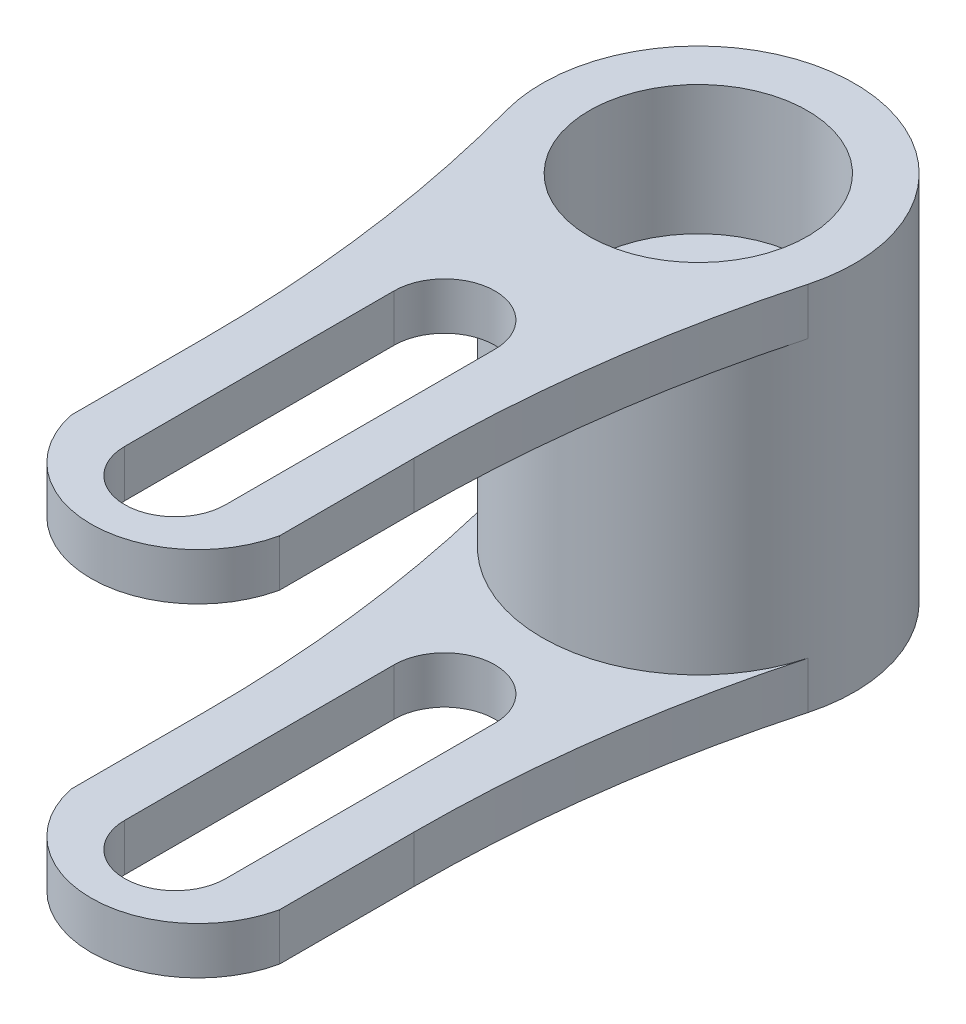
ISO-10303-21;
HEADER;
FILE_DESCRIPTION(('STEP AP214'),'2;1');
FILE_NAME('part.step','',(''),(''),'','','');
FILE_SCHEMA(('AUTOMOTIVE_DESIGN { 1 0 10303 214 1 1 1 1 }'));
ENDSEC;
DATA;
#1=APPLICATION_CONTEXT('core data for automotive mechanical design processes');
#2=APPLICATION_PROTOCOL_DEFINITION('international standard','automotive_design',2000,#1);
#3=PRODUCT_CONTEXT('',#1,'mechanical');
#4=PRODUCT('Part','Part','',(#3));
#5=PRODUCT_RELATED_PRODUCT_CATEGORY('part','',(#4));
#6=PRODUCT_DEFINITION_FORMATION('','',#4);
#7=PRODUCT_DEFINITION_CONTEXT('part definition',#1,'design');
#8=PRODUCT_DEFINITION('design','',#6,#7);
#9=PRODUCT_DEFINITION_SHAPE('','',#8);
#10=(LENGTH_UNIT() NAMED_UNIT(*) SI_UNIT(.MILLI.,.METRE.));
#11=(NAMED_UNIT(*) PLANE_ANGLE_UNIT() SI_UNIT($,.RADIAN.));
#12=(NAMED_UNIT(*) SI_UNIT($,.STERADIAN.) SOLID_ANGLE_UNIT());
#13=UNCERTAINTY_MEASURE_WITH_UNIT(LENGTH_MEASURE(1.E-05),#10,'distance_accuracy_value','');
#14=(GEOMETRIC_REPRESENTATION_CONTEXT(3) GLOBAL_UNCERTAINTY_ASSIGNED_CONTEXT((#13)) GLOBAL_UNIT_ASSIGNED_CONTEXT((#10,
#11,#12)) REPRESENTATION_CONTEXT('',''));
#15=CARTESIAN_POINT('',(0.,0.,0.));
#16=DIRECTION('',(0.,0.,1.));
#17=DIRECTION('',(1.,0.,0.));
#18=AXIS2_PLACEMENT_3D('',#15,#16,#17);
#19=CARTESIAN_POINT('',(0.,6.8875,0.));
#20=DIRECTION('',(0.,1.,0.));
#21=DIRECTION('',(0.,0.,1.));
#22=AXIS2_PLACEMENT_3D('',#19,#20,#21);
#23=PLANE('',#22);
#24=CARTESIAN_POINT('',(0.,6.8875,19.425));
#25=DIRECTION('',(0.,1.,0.));
#26=DIRECTION('',(0.,0.,1.));
#27=AXIS2_PLACEMENT_3D('',#24,#25,#26);
#28=CIRCLE('',#27,1.875);
#29=CARTESIAN_POINT('',(-1.875,6.8875,19.425));
#30=VERTEX_POINT('',#29);
#31=CARTESIAN_POINT('',(1.875,6.8875,19.425));
#32=VERTEX_POINT('',#31);
#33=EDGE_CURVE('E308',#30,#32,#28,.T.);
#34=ORIENTED_EDGE('',*,*,#33,.F.);
#35=DIRECTION('',(0.,0.,1.));
#36=VECTOR('',#35,1.);
#37=CARTESIAN_POINT('',(-1.875,6.8875,0.));
#38=LINE('',#37,#36);
#39=CARTESIAN_POINT('',(-1.875,6.8875,9.425));
#40=VERTEX_POINT('',#39);
#41=EDGE_CURVE('E313',#40,#30,#38,.T.);
#42=ORIENTED_EDGE('',*,*,#41,.F.);
#43=CARTESIAN_POINT('',(0.,6.8875,9.425));
#44=DIRECTION('',(0.,1.,0.));
#45=DIRECTION('',(0.,0.,1.));
#46=AXIS2_PLACEMENT_3D('',#43,#44,#45);
#47=CIRCLE('',#46,1.875);
#48=CARTESIAN_POINT('',(1.875,6.8875,9.425));
#49=VERTEX_POINT('',#48);
#50=EDGE_CURVE('E317',#49,#40,#47,.T.);
#51=ORIENTED_EDGE('',*,*,#50,.F.);
#52=DIRECTION('',(0.,0.,1.));
#53=VECTOR('',#52,1.);
#54=CARTESIAN_POINT('',(1.875,6.8875,0.));
#55=LINE('',#54,#53);
#56=EDGE_CURVE('E324',#49,#32,#55,.T.);
#57=ORIENTED_EDGE('',*,*,#56,.T.);
#58=EDGE_LOOP('',(#34,#42,#51,#57));
#59=FACE_BOUND('',#58,.T.);
#60=CARTESIAN_POINT('',(0.,6.8875,0.));
#61=DIRECTION('',(0.,1.,0.));
#62=DIRECTION('',(0.,0.,1.));
#63=AXIS2_PLACEMENT_3D('',#60,#61,#62);
#64=CIRCLE('',#63,4.05);
#65=CARTESIAN_POINT('',(0.,6.8875,4.05));
#66=VERTEX_POINT('',#65);
#67=EDGE_CURVE('E378',#66,#66,#64,.T.);
#68=ORIENTED_EDGE('',*,*,#67,.F.);
#69=EDGE_LOOP('',(#68));
#70=FACE_BOUND('',#69,.T.);
#71=CARTESIAN_POINT('',(0.,6.8875,18.585));
#72=DIRECTION('',(0.,1.,0.));
#73=DIRECTION('',(0.,0.,1.));
#74=AXIS2_PLACEMENT_3D('',#71,#72,#73);
#75=CIRCLE('',#74,3.965);
#76=CARTESIAN_POINT('',(-3.875,6.8875,19.425));
#77=VERTEX_POINT('',#76);
#78=CARTESIAN_POINT('',(3.875,6.8875,19.425));
#79=VERTEX_POINT('',#78);
#80=EDGE_CURVE('E202',#77,#79,#75,.T.);
#81=ORIENTED_EDGE('',*,*,#80,.T.);
#82=DIRECTION('',(0.,0.,-1.));
#83=VECTOR('',#82,1.);
#84=CARTESIAN_POINT('',(3.87499999999999,6.8875,0.));
#85=LINE('',#84,#83);
#86=CARTESIAN_POINT('',(3.875,6.8875,14.425));
#87=VERTEX_POINT('',#86);
#88=EDGE_CURVE('E326',#79,#87,#85,.T.);
#89=ORIENTED_EDGE('',*,*,#88,.T.);
#90=CARTESIAN_POINT('',(53.0844155844154,6.8875,14.425));
#91=DIRECTION('',(0.,1.,0.));
#92=DIRECTION('',(0.,0.,1.));
#93=AXIS2_PLACEMENT_3D('',#90,#91,#92);
#94=CIRCLE('',#93,49.2094155844154);
#95=CARTESIAN_POINT('',(5.59703474611784,6.8875,1.52092144792214));
#96=VERTEX_POINT('',#95);
#97=EDGE_CURVE('E328',#87,#96,#94,.F.);
#98=ORIENTED_EDGE('',*,*,#97,.T.);
#99=CARTESIAN_POINT('',(0.,6.8875,0.));
#100=DIRECTION('',(0.,1.,0.));
#101=DIRECTION('',(0.,0.,1.));
#102=AXIS2_PLACEMENT_3D('',#99,#100,#101);
#103=CIRCLE('',#102,5.8);
#104=CARTESIAN_POINT('',(-5.59703474611784,6.8875,1.52092144792214));
#105=VERTEX_POINT('',#104);
#106=EDGE_CURVE('E330',#96,#105,#103,.T.);
#107=ORIENTED_EDGE('',*,*,#106,.T.);
#108=CARTESIAN_POINT('',(-53.0844155844154,6.8875,14.425));
#109=DIRECTION('',(0.,1.,0.));
#110=DIRECTION('',(0.,0.,1.));
#111=AXIS2_PLACEMENT_3D('',#108,#109,#110);
#112=CIRCLE('',#111,49.2094155844154);
#113=CARTESIAN_POINT('',(-3.875,6.8875,14.425));
#114=VERTEX_POINT('',#113);
#115=EDGE_CURVE('E218',#105,#114,#112,.F.);
#116=ORIENTED_EDGE('',*,*,#115,.T.);
#117=DIRECTION('',(0.,0.,1.));
#118=VECTOR('',#117,1.);
#119=CARTESIAN_POINT('',(-3.87499999999999,6.8875,0.));
#120=LINE('',#119,#118);
#121=EDGE_CURVE('E216',#114,#77,#120,.T.);
#122=ORIENTED_EDGE('',*,*,#121,.T.);
#123=EDGE_LOOP('',(#81,#89,#98,#107,#116,#122));
#124=FACE_BOUND('',#123,.T.);
#125=ADVANCED_FACE('F66',(#59,#70,#124),#23,.T.);
#126=CARTESIAN_POINT('',(0.,-6.8875,0.));
#127=DIRECTION('',(0.,1.,0.));
#128=DIRECTION('',(0.,0.,1.));
#129=AXIS2_PLACEMENT_3D('',#126,#127,#128);
#130=PLANE('',#129);
#131=CARTESIAN_POINT('',(0.,-6.8875,19.425));
#132=DIRECTION('',(0.,1.,0.));
#133=DIRECTION('',(0.,0.,1.));
#134=AXIS2_PLACEMENT_3D('',#131,#132,#133);
#135=CIRCLE('',#134,1.875);
#136=CARTESIAN_POINT('',(-1.875,-6.8875,19.425));
#137=VERTEX_POINT('',#136);
#138=CARTESIAN_POINT('',(1.875,-6.8875,19.425));
#139=VERTEX_POINT('',#138);
#140=EDGE_CURVE('E278',#137,#139,#135,.T.);
#141=ORIENTED_EDGE('',*,*,#140,.T.);
#142=DIRECTION('',(0.,0.,1.));
#143=VECTOR('',#142,1.);
#144=CARTESIAN_POINT('',(1.875,-6.8875,0.));
#145=LINE('',#144,#143);
#146=CARTESIAN_POINT('',(1.875,-6.8875,9.425));
#147=VERTEX_POINT('',#146);
#148=EDGE_CURVE('E291',#147,#139,#145,.T.);
#149=ORIENTED_EDGE('',*,*,#148,.F.);
#150=CARTESIAN_POINT('',(0.,-6.8875,9.425));
#151=DIRECTION('',(0.,1.,0.));
#152=DIRECTION('',(0.,0.,1.));
#153=AXIS2_PLACEMENT_3D('',#150,#151,#152);
#154=CIRCLE('',#153,1.875);
#155=CARTESIAN_POINT('',(-1.875,-6.8875,9.425));
#156=VERTEX_POINT('',#155);
#157=EDGE_CURVE('E289',#147,#156,#154,.T.);
#158=ORIENTED_EDGE('',*,*,#157,.T.);
#159=DIRECTION('',(0.,0.,1.));
#160=VECTOR('',#159,1.);
#161=CARTESIAN_POINT('',(-1.875,-6.8875,0.));
#162=LINE('',#161,#160);
#163=EDGE_CURVE('E272',#156,#137,#162,.T.);
#164=ORIENTED_EDGE('',*,*,#163,.T.);
#165=EDGE_LOOP('',(#141,#149,#158,#164));
#166=FACE_BOUND('',#165,.T.);
#167=DIRECTION('',(0.,0.,-1.));
#168=VECTOR('',#167,1.);
#169=CARTESIAN_POINT('',(3.87499999999999,-6.8875,0.));
#170=LINE('',#169,#168);
#171=CARTESIAN_POINT('',(3.875,-6.8875,19.425));
#172=VERTEX_POINT('',#171);
#173=CARTESIAN_POINT('',(3.875,-6.8875,14.425));
#174=VERTEX_POINT('',#173);
#175=EDGE_CURVE('E295',#172,#174,#170,.T.);
#176=ORIENTED_EDGE('',*,*,#175,.F.);
#177=CARTESIAN_POINT('',(0.,-6.8875,18.585));
#178=DIRECTION('',(0.,1.,0.));
#179=DIRECTION('',(0.,0.,1.));
#180=AXIS2_PLACEMENT_3D('',#177,#178,#179);
#181=CIRCLE('',#180,3.965);
#182=CARTESIAN_POINT('',(-3.875,-6.8875,19.425));
#183=VERTEX_POINT('',#182);
#184=EDGE_CURVE('E213',#183,#172,#181,.T.);
#185=ORIENTED_EDGE('',*,*,#184,.F.);
#186=DIRECTION('',(0.,0.,1.));
#187=VECTOR('',#186,1.);
#188=CARTESIAN_POINT('',(-3.87499999999999,-6.8875,0.));
#189=LINE('',#188,#187);
#190=CARTESIAN_POINT('',(-3.875,-6.8875,14.425));
#191=VERTEX_POINT('',#190);
#192=EDGE_CURVE('E306',#191,#183,#189,.T.);
#193=ORIENTED_EDGE('',*,*,#192,.F.);
#194=CARTESIAN_POINT('',(-53.0844155844154,-6.8875,14.425));
#195=DIRECTION('',(0.,1.,0.));
#196=DIRECTION('',(0.,0.,1.));
#197=AXIS2_PLACEMENT_3D('',#194,#195,#196);
#198=CIRCLE('',#197,49.2094155844154);
#199=CARTESIAN_POINT('',(-5.59703474611784,-6.8875,1.52092144792214));
#200=VERTEX_POINT('',#199);
#201=EDGE_CURVE('E304',#200,#191,#198,.F.);
#202=ORIENTED_EDGE('',*,*,#201,.F.);
#203=CARTESIAN_POINT('',(0.,-6.8875,0.));
#204=DIRECTION('',(0.,1.,0.));
#205=DIRECTION('',(0.,0.,1.));
#206=AXIS2_PLACEMENT_3D('',#203,#204,#205);
#207=CIRCLE('',#206,5.8);
#208=CARTESIAN_POINT('',(5.59703474611784,-6.8875,1.52092144792214));
#209=VERTEX_POINT('',#208);
#210=EDGE_CURVE('E301',#209,#200,#207,.T.);
#211=ORIENTED_EDGE('',*,*,#210,.F.);
#212=CARTESIAN_POINT('',(53.0844155844154,-6.8875,14.425));
#213=DIRECTION('',(0.,1.,0.));
#214=DIRECTION('',(0.,0.,1.));
#215=AXIS2_PLACEMENT_3D('',#212,#213,#214);
#216=CIRCLE('',#215,49.2094155844154);
#217=EDGE_CURVE('E298',#174,#209,#216,.F.);
#218=ORIENTED_EDGE('',*,*,#217,.F.);
#219=EDGE_LOOP('',(#176,#185,#193,#202,#211,#218));
#220=FACE_BOUND('',#219,.T.);
#221=ADVANCED_FACE('F286',(#166,#220),#130,.F.);
#222=CARTESIAN_POINT('',(-53.0844155844154,-5.137499944,14.425));
#223=DIRECTION('',(0.,-1.,0.));
#224=DIRECTION('',(0.,0.,-1.));
#225=AXIS2_PLACEMENT_3D('',#222,#223,#224);
#226=PLANE('',#225);
#227=CARTESIAN_POINT('',(0.,-5.137499944,19.425));
#228=DIRECTION('',(0.,-1.,0.));
#229=DIRECTION('',(0.,0.,-1.));
#230=AXIS2_PLACEMENT_3D('',#227,#228,#229);
#231=CIRCLE('',#230,1.875);
#232=CARTESIAN_POINT('',(1.875,-5.137499944,19.4250000000125));
#233=VERTEX_POINT('',#232);
#234=CARTESIAN_POINT('',(-1.87499999998408,-5.137499944,19.4250000000125));
#235=VERTEX_POINT('',#234);
#236=EDGE_CURVE('E367',#233,#235,#231,.T.);
#237=ORIENTED_EDGE('',*,*,#236,.T.);
#238=DIRECTION('',(0.,0.,-1.));
#239=VECTOR('',#238,1.);
#240=CARTESIAN_POINT('',(-1.87499999998408,-5.137499944,291592.4975));
#241=LINE('',#240,#239);
#242=CARTESIAN_POINT('',(-1.875,-5.137499944,9.42499999996471));
#243=VERTEX_POINT('',#242);
#244=EDGE_CURVE('E274',#235,#243,#241,.T.);
#245=ORIENTED_EDGE('',*,*,#244,.T.);
#246=CARTESIAN_POINT('',(0.,-5.137499944,9.425));
#247=DIRECTION('',(0.,-1.,0.));
#248=DIRECTION('',(0.,0.,-1.));
#249=AXIS2_PLACEMENT_3D('',#246,#247,#248);
#250=CIRCLE('',#249,1.875);
#251=CARTESIAN_POINT('',(1.875,-5.137499944,9.425));
#252=VERTEX_POINT('',#251);
#253=EDGE_CURVE('E81',#243,#252,#250,.T.);
#254=ORIENTED_EDGE('',*,*,#253,.T.);
#255=DIRECTION('',(0.,0.,-1.));
#256=VECTOR('',#255,1.);
#257=CARTESIAN_POINT('',(1.87499999998408,-5.137499944,291592.4975));
#258=LINE('',#257,#256);
#259=EDGE_CURVE('E361',#233,#252,#258,.T.);
#260=ORIENTED_EDGE('',*,*,#259,.F.);
#261=EDGE_LOOP('',(#237,#245,#254,#260));
#262=FACE_BOUND('',#261,.T.);
#263=DIRECTION('',(0.,0.,-1.));
#264=VECTOR('',#263,1.);
#265=CARTESIAN_POINT('',(-3.87500000016416,-5.137499944,291592.4975));
#266=LINE('',#265,#264);
#267=CARTESIAN_POINT('',(-3.875,-5.137499944,19.425));
#268=VERTEX_POINT('',#267);
#269=CARTESIAN_POINT('',(-3.875,-5.137499944,14.425000000017));
#270=VERTEX_POINT('',#269);
#271=EDGE_CURVE('E369',#268,#270,#266,.T.);
#272=ORIENTED_EDGE('',*,*,#271,.F.);
#273=CARTESIAN_POINT('',(0.,-5.137499944,18.585));
#274=DIRECTION('',(0.,-1.,0.));
#275=DIRECTION('',(0.,0.,-1.));
#276=AXIS2_PLACEMENT_3D('',#273,#274,#275);
#277=CIRCLE('',#276,3.965);
#278=CARTESIAN_POINT('',(3.875,-5.137499944,19.4250000000125));
#279=VERTEX_POINT('',#278);
#280=EDGE_CURVE('E212',#268,#279,#277,.F.);
#281=ORIENTED_EDGE('',*,*,#280,.T.);
#282=DIRECTION('',(0.,0.,1.));
#283=VECTOR('',#282,1.);
#284=CARTESIAN_POINT('',(3.87500000016416,-5.137499944,291592.4975));
#285=LINE('',#284,#283);
#286=CARTESIAN_POINT('',(3.87500000001242,-5.137499944,14.4249999999602));
#287=VERTEX_POINT('',#286);
#288=EDGE_CURVE('E364',#287,#279,#285,.T.);
#289=ORIENTED_EDGE('',*,*,#288,.F.);
#290=CARTESIAN_POINT('',(53.0844155844154,-5.137499944,14.425));
#291=DIRECTION('',(0.,-1.,0.));
#292=DIRECTION('',(0.,0.,-1.));
#293=AXIS2_PLACEMENT_3D('',#290,#291,#292);
#294=CIRCLE('',#293,49.2094155844154);
#295=CARTESIAN_POINT('',(5.59703474611784,-5.137499944,1.52092144792215));
#296=VERTEX_POINT('',#295);
#297=EDGE_CURVE('E359',#287,#296,#294,.T.);
#298=ORIENTED_EDGE('',*,*,#297,.T.);
#299=CARTESIAN_POINT('',(0.,-5.137499944,0.));
#300=DIRECTION('',(0.,-1.,0.));
#301=DIRECTION('',(0.,0.,-1.));
#302=AXIS2_PLACEMENT_3D('',#299,#300,#301);
#303=CIRCLE('',#302,5.8);
#304=CARTESIAN_POINT('',(-5.59703474611784,-5.137499944,1.52092144792214));
#305=VERTEX_POINT('',#304);
#306=EDGE_CURVE('E373',#296,#305,#303,.T.);
#307=ORIENTED_EDGE('',*,*,#306,.T.);
#308=CARTESIAN_POINT('',(-53.0844155844154,-5.137499944,14.425));
#309=DIRECTION('',(0.,-1.,0.));
#310=DIRECTION('',(0.,0.,-1.));
#311=AXIS2_PLACEMENT_3D('',#308,#309,#310);
#312=CIRCLE('',#311,49.2094155844154);
#313=EDGE_CURVE('E353',#305,#270,#312,.T.);
#314=ORIENTED_EDGE('',*,*,#313,.T.);
#315=EDGE_LOOP('',(#272,#281,#289,#298,#307,#314));
#316=FACE_BOUND('',#315,.T.);
#317=ADVANCED_FACE('F402',(#262,#316),#226,.F.);
#318=CARTESIAN_POINT('',(0.,5.137499944,0.));
#319=DIRECTION('',(0.,1.,0.));
#320=DIRECTION('',(0.,0.,1.));
#321=AXIS2_PLACEMENT_3D('',#318,#319,#320);
#322=PLANE('',#321);
#323=DIRECTION('',(0.,0.,-1.));
#324=VECTOR('',#323,1.);
#325=CARTESIAN_POINT('',(1.87499999998408,5.137499944,291592.4975));
#326=LINE('',#325,#324);
#327=CARTESIAN_POINT('',(1.875,5.137499944,19.425));
#328=VERTEX_POINT('',#327);
#329=CARTESIAN_POINT('',(1.875,5.137499944,9.42499999996471));
#330=VERTEX_POINT('',#329);
#331=EDGE_CURVE('E351',#328,#330,#326,.T.);
#332=ORIENTED_EDGE('',*,*,#331,.T.);
#333=CARTESIAN_POINT('',(0.,5.137499944,9.425));
#334=DIRECTION('',(0.,1.,0.));
#335=DIRECTION('',(0.,0.,1.));
#336=AXIS2_PLACEMENT_3D('',#333,#334,#335);
#337=CIRCLE('',#336,1.875);
#338=CARTESIAN_POINT('',(-1.875,5.137499944,9.42499999996471));
#339=VERTEX_POINT('',#338);
#340=EDGE_CURVE('E284',#339,#330,#337,.F.);
#341=ORIENTED_EDGE('',*,*,#340,.F.);
#342=DIRECTION('',(0.,0.,-1.));
#343=VECTOR('',#342,1.);
#344=CARTESIAN_POINT('',(-1.87499999998408,5.137499944,291592.4975));
#345=LINE('',#344,#343);
#346=CARTESIAN_POINT('',(-1.875,5.137499944,19.4250000000125));
#347=VERTEX_POINT('',#346);
#348=EDGE_CURVE('E344',#347,#339,#345,.T.);
#349=ORIENTED_EDGE('',*,*,#348,.F.);
#350=CARTESIAN_POINT('',(0.,5.137499944,19.425));
#351=DIRECTION('',(0.,1.,0.));
#352=DIRECTION('',(0.,0.,1.));
#353=AXIS2_PLACEMENT_3D('',#350,#351,#352);
#354=CIRCLE('',#353,1.875);
#355=EDGE_CURVE('E89',#328,#347,#354,.F.);
#356=ORIENTED_EDGE('',*,*,#355,.F.);
#357=EDGE_LOOP('',(#332,#341,#349,#356));
#358=FACE_BOUND('',#357,.T.);
#359=DIRECTION('',(0.,0.,1.));
#360=VECTOR('',#359,1.);
#361=CARTESIAN_POINT('',(3.87500000016416,5.137499944,291592.4975));
#362=LINE('',#361,#360);
#363=CARTESIAN_POINT('',(3.87500000001242,5.137499944,14.4249999999602));
#364=VERTEX_POINT('',#363);
#365=CARTESIAN_POINT('',(3.875,5.137499944,19.425));
#366=VERTEX_POINT('',#365);
#367=EDGE_CURVE('E355',#364,#366,#362,.T.);
#368=ORIENTED_EDGE('',*,*,#367,.T.);
#369=CARTESIAN_POINT('',(0.,5.137499944,18.585));
#370=DIRECTION('',(0.,1.,0.));
#371=DIRECTION('',(0.,0.,1.));
#372=AXIS2_PLACEMENT_3D('',#369,#370,#371);
#373=CIRCLE('',#372,3.965);
#374=CARTESIAN_POINT('',(-3.875,5.137499944,19.4250000000125));
#375=VERTEX_POINT('',#374);
#376=EDGE_CURVE('E12',#366,#375,#373,.F.);
#377=ORIENTED_EDGE('',*,*,#376,.T.);
#378=DIRECTION('',(0.,0.,-1.));
#379=VECTOR('',#378,1.);
#380=CARTESIAN_POINT('',(-3.87500000016416,5.137499944,291592.4975));
#381=LINE('',#380,#379);
#382=CARTESIAN_POINT('',(-3.875,5.137499944,14.425000000017));
#383=VERTEX_POINT('',#382);
#384=EDGE_CURVE('E226',#375,#383,#381,.T.);
#385=ORIENTED_EDGE('',*,*,#384,.T.);
#386=CARTESIAN_POINT('',(-53.0844155844154,5.137499944,14.425));
#387=DIRECTION('',(0.,1.,0.));
#388=DIRECTION('',(0.,0.,1.));
#389=AXIS2_PLACEMENT_3D('',#386,#387,#388);
#390=CIRCLE('',#389,49.2094155844154);
#391=CARTESIAN_POINT('',(-5.59703474611784,5.137499944,1.52092144792214));
#392=VERTEX_POINT('',#391);
#393=EDGE_CURVE('E342',#392,#383,#390,.F.);
#394=ORIENTED_EDGE('',*,*,#393,.F.);
#395=CARTESIAN_POINT('',(0.,5.137499944,0.));
#396=DIRECTION('',(0.,1.,0.));
#397=DIRECTION('',(0.,0.,1.));
#398=AXIS2_PLACEMENT_3D('',#395,#396,#397);
#399=CIRCLE('',#398,5.8);
#400=CARTESIAN_POINT('',(5.59703474611784,5.137499944,1.52092144792215));
#401=VERTEX_POINT('',#400);
#402=EDGE_CURVE('E338',#401,#392,#399,.F.);
#403=ORIENTED_EDGE('',*,*,#402,.F.);
#404=CARTESIAN_POINT('',(53.0844155844154,5.137499944,14.425));
#405=DIRECTION('',(0.,1.,0.));
#406=DIRECTION('',(0.,0.,1.));
#407=AXIS2_PLACEMENT_3D('',#404,#405,#406);
#408=CIRCLE('',#407,49.2094155844154);
#409=EDGE_CURVE('E345',#364,#401,#408,.F.);
#410=ORIENTED_EDGE('',*,*,#409,.F.);
#411=EDGE_LOOP('',(#368,#377,#385,#394,#403,#410));
#412=FACE_BOUND('',#411,.T.);
#413=ADVANCED_FACE('F427',(#358,#412),#322,.F.);
#414=CARTESIAN_POINT('',(3.87499999999999,6.8875,0.));
#415=DIRECTION('',(-1.,0.,0.));
#416=DIRECTION('',(0.,0.,1.));
#417=AXIS2_PLACEMENT_3D('',#414,#415,#416);
#418=PLANE('',#417);
#419=DIRECTION('',(0.,-1.,0.));
#420=VECTOR('',#419,1.);
#421=CARTESIAN_POINT('',(3.875,6.8875,14.425));
#422=LINE('',#421,#420);
#423=EDGE_CURVE('E243',#287,#174,#422,.T.);
#424=ORIENTED_EDGE('',*,*,#423,.F.);
#425=ORIENTED_EDGE('',*,*,#288,.T.);
#426=DIRECTION('',(0.,-1.,0.));
#427=VECTOR('',#426,1.);
#428=CARTESIAN_POINT('',(3.875,6.8875,19.425));
#429=LINE('',#428,#427);
#430=EDGE_CURVE('E259',#279,#172,#429,.T.);
#431=ORIENTED_EDGE('',*,*,#430,.T.);
#432=ORIENTED_EDGE('',*,*,#175,.T.);
#433=EDGE_LOOP('',(#424,#425,#431,#432));
#434=FACE_BOUND('',#433,.T.);
#435=ADVANCED_FACE('F391',(#434),#418,.F.);
#436=CARTESIAN_POINT('',(53.0844155844154,6.8875,14.425));
#437=DIRECTION('',(0.,-1.,0.));
#438=DIRECTION('',(0.,0.,-1.));
#439=AXIS2_PLACEMENT_3D('',#436,#437,#438);
#440=CYLINDRICAL_SURFACE('',#439,49.2094155844154);
#441=DIRECTION('',(0.,-1.,0.));
#442=VECTOR('',#441,1.);
#443=CARTESIAN_POINT('',(5.59703474611784,6.8875,1.52092144792214));
#444=LINE('',#443,#442);
#445=EDGE_CURVE('E239',#296,#209,#444,.T.);
#446=ORIENTED_EDGE('',*,*,#445,.F.);
#447=ORIENTED_EDGE('',*,*,#297,.F.);
#448=ORIENTED_EDGE('',*,*,#423,.T.);
#449=ORIENTED_EDGE('',*,*,#217,.T.);
#450=EDGE_LOOP('',(#446,#447,#448,#449));
#451=FACE_BOUND('',#450,.T.);
#452=ADVANCED_FACE('F397',(#451),#440,.F.);
#453=CARTESIAN_POINT('',(-53.0844155844154,6.8875,14.425));
#454=DIRECTION('',(0.,-1.,0.));
#455=DIRECTION('',(0.,0.,-1.));
#456=AXIS2_PLACEMENT_3D('',#453,#454,#455);
#457=CYLINDRICAL_SURFACE('',#456,49.2094155844154);
#458=DIRECTION('',(0.,-1.,0.));
#459=VECTOR('',#458,1.);
#460=CARTESIAN_POINT('',(-3.875,6.8875,14.425));
#461=LINE('',#460,#459);
#462=EDGE_CURVE('E227',#270,#191,#461,.T.);
#463=ORIENTED_EDGE('',*,*,#462,.F.);
#464=ORIENTED_EDGE('',*,*,#313,.F.);
#465=DIRECTION('',(0.,-1.,0.));
#466=VECTOR('',#465,1.);
#467=CARTESIAN_POINT('',(-5.59703474611784,6.8875,1.52092144792214));
#468=LINE('',#467,#466);
#469=EDGE_CURVE('E235',#305,#200,#468,.T.);
#470=ORIENTED_EDGE('',*,*,#469,.T.);
#471=ORIENTED_EDGE('',*,*,#201,.T.);
#472=EDGE_LOOP('',(#463,#464,#470,#471));
#473=FACE_BOUND('',#472,.T.);
#474=ADVANCED_FACE('F408',(#473),#457,.F.);
#475=CARTESIAN_POINT('',(-3.87499999999999,6.8875,0.));
#476=DIRECTION('',(1.,0.,0.));
#477=DIRECTION('',(0.,0.,-1.));
#478=AXIS2_PLACEMENT_3D('',#475,#476,#477);
#479=PLANE('',#478);
#480=DIRECTION('',(0.,-1.,0.));
#481=VECTOR('',#480,1.);
#482=CARTESIAN_POINT('',(-3.875,6.8875,19.425));
#483=LINE('',#482,#481);
#484=EDGE_CURVE('E228',#268,#183,#483,.T.);
#485=ORIENTED_EDGE('',*,*,#484,.F.);
#486=ORIENTED_EDGE('',*,*,#271,.T.);
#487=ORIENTED_EDGE('',*,*,#462,.T.);
#488=ORIENTED_EDGE('',*,*,#192,.T.);
#489=EDGE_LOOP('',(#485,#486,#487,#488));
#490=FACE_BOUND('',#489,.T.);
#491=ADVANCED_FACE('F409',(#490),#479,.F.);
#492=CARTESIAN_POINT('',(0.,6.8875,19.425));
#493=DIRECTION('',(0.,-1.,0.));
#494=DIRECTION('',(0.,0.,-1.));
#495=AXIS2_PLACEMENT_3D('',#492,#493,#494);
#496=CYLINDRICAL_SURFACE('',#495,1.875);
#497=ORIENTED_EDGE('',*,*,#236,.F.);
#498=DIRECTION('',(0.,-1.,0.));
#499=VECTOR('',#498,1.);
#500=CARTESIAN_POINT('',(1.875,6.8875,19.425));
#501=LINE('',#500,#499);
#502=EDGE_CURVE('E222',#233,#139,#501,.T.);
#503=ORIENTED_EDGE('',*,*,#502,.T.);
#504=ORIENTED_EDGE('',*,*,#140,.F.);
#505=DIRECTION('',(0.,-1.,0.));
#506=VECTOR('',#505,1.);
#507=CARTESIAN_POINT('',(-1.875,6.8875,19.425));
#508=LINE('',#507,#506);
#509=EDGE_CURVE('E256',#235,#137,#508,.T.);
#510=ORIENTED_EDGE('',*,*,#509,.F.);
#511=EDGE_LOOP('',(#497,#503,#504,#510));
#512=FACE_BOUND('',#511,.T.);
#513=ADVANCED_FACE('F279',(#512),#496,.F.);
#514=CARTESIAN_POINT('',(-1.875,6.8875,0.));
#515=DIRECTION('',(1.,0.,0.));
#516=DIRECTION('',(0.,0.,-1.));
#517=AXIS2_PLACEMENT_3D('',#514,#515,#516);
#518=PLANE('',#517);
#519=ORIENTED_EDGE('',*,*,#244,.F.);
#520=ORIENTED_EDGE('',*,*,#509,.T.);
#521=ORIENTED_EDGE('',*,*,#163,.F.);
#522=DIRECTION('',(0.,-1.,0.));
#523=VECTOR('',#522,1.);
#524=CARTESIAN_POINT('',(-1.875,6.8875,9.425));
#525=LINE('',#524,#523);
#526=EDGE_CURVE('E253',#243,#156,#525,.T.);
#527=ORIENTED_EDGE('',*,*,#526,.F.);
#528=EDGE_LOOP('',(#519,#520,#521,#527));
#529=FACE_BOUND('',#528,.T.);
#530=ADVANCED_FACE('F269',(#529),#518,.T.);
#531=CARTESIAN_POINT('',(0.,6.8875,9.425));
#532=DIRECTION('',(0.,-1.,0.));
#533=DIRECTION('',(0.,0.,-1.));
#534=AXIS2_PLACEMENT_3D('',#531,#532,#533);
#535=CYLINDRICAL_SURFACE('',#534,1.875);
#536=ORIENTED_EDGE('',*,*,#253,.F.);
#537=ORIENTED_EDGE('',*,*,#526,.T.);
#538=ORIENTED_EDGE('',*,*,#157,.F.);
#539=DIRECTION('',(0.,-1.,0.));
#540=VECTOR('',#539,1.);
#541=CARTESIAN_POINT('',(1.875,6.8875,9.425));
#542=LINE('',#541,#540);
#543=EDGE_CURVE('E249',#252,#147,#542,.T.);
#544=ORIENTED_EDGE('',*,*,#543,.F.);
#545=EDGE_LOOP('',(#536,#537,#538,#544));
#546=FACE_BOUND('',#545,.T.);
#547=ADVANCED_FACE('F474',(#546),#535,.F.);
#548=CARTESIAN_POINT('',(1.875,6.8875,0.));
#549=DIRECTION('',(1.,0.,0.));
#550=DIRECTION('',(0.,0.,-1.));
#551=AXIS2_PLACEMENT_3D('',#548,#549,#550);
#552=PLANE('',#551);
#553=ORIENTED_EDGE('',*,*,#502,.F.);
#554=ORIENTED_EDGE('',*,*,#259,.T.);
#555=ORIENTED_EDGE('',*,*,#543,.T.);
#556=ORIENTED_EDGE('',*,*,#148,.T.);
#557=EDGE_LOOP('',(#553,#554,#555,#556));
#558=FACE_BOUND('',#557,.T.);
#559=ADVANCED_FACE('F465',(#558),#552,.F.);
#560=EDGE_CURVE('E208',#79,#366,#429,.T.);
#561=ORIENTED_EDGE('',*,*,#560,.T.);
#562=ORIENTED_EDGE('',*,*,#367,.F.);
#563=EDGE_CURVE('E74',#87,#364,#422,.T.);
#564=ORIENTED_EDGE('',*,*,#563,.F.);
#565=ORIENTED_EDGE('',*,*,#88,.F.);
#566=EDGE_LOOP('',(#561,#562,#564,#565));
#567=FACE_BOUND('',#566,.T.);
#568=ADVANCED_FACE('F506',(#567),#418,.F.);
#569=ORIENTED_EDGE('',*,*,#563,.T.);
#570=ORIENTED_EDGE('',*,*,#409,.T.);
#571=EDGE_CURVE('E240',#96,#401,#444,.T.);
#572=ORIENTED_EDGE('',*,*,#571,.F.);
#573=ORIENTED_EDGE('',*,*,#97,.F.);
#574=EDGE_LOOP('',(#569,#570,#572,#573));
#575=FACE_BOUND('',#574,.T.);
#576=ADVANCED_FACE('F499',(#575),#440,.F.);
#577=CARTESIAN_POINT('',(0.,6.8875,0.));
#578=DIRECTION('',(0.,-1.,0.));
#579=DIRECTION('',(0.,0.,-1.));
#580=AXIS2_PLACEMENT_3D('',#577,#578,#579);
#581=CYLINDRICAL_SURFACE('',#580,5.8);
#582=ORIENTED_EDGE('',*,*,#306,.F.);
#583=ORIENTED_EDGE('',*,*,#445,.T.);
#584=ORIENTED_EDGE('',*,*,#210,.T.);
#585=ORIENTED_EDGE('',*,*,#469,.F.);
#586=EDGE_LOOP('',(#582,#583,#584,#585));
#587=FACE_BOUND('',#586,.T.);
#588=ORIENTED_EDGE('',*,*,#571,.T.);
#589=ORIENTED_EDGE('',*,*,#402,.T.);
#590=EDGE_CURVE('E236',#105,#392,#468,.T.);
#591=ORIENTED_EDGE('',*,*,#590,.F.);
#592=ORIENTED_EDGE('',*,*,#106,.F.);
#593=EDGE_LOOP('',(#588,#589,#591,#592));
#594=FACE_BOUND('',#593,.T.);
#595=ADVANCED_FACE('F337',(#587,#594),#581,.T.);
#596=ORIENTED_EDGE('',*,*,#590,.T.);
#597=ORIENTED_EDGE('',*,*,#393,.T.);
#598=EDGE_CURVE('E230',#114,#383,#461,.T.);
#599=ORIENTED_EDGE('',*,*,#598,.F.);
#600=ORIENTED_EDGE('',*,*,#115,.F.);
#601=EDGE_LOOP('',(#596,#597,#599,#600));
#602=FACE_BOUND('',#601,.T.);
#603=ADVANCED_FACE('F341',(#602),#457,.F.);
#604=ORIENTED_EDGE('',*,*,#598,.T.);
#605=ORIENTED_EDGE('',*,*,#384,.F.);
#606=EDGE_CURVE('E206',#77,#375,#483,.T.);
#607=ORIENTED_EDGE('',*,*,#606,.F.);
#608=ORIENTED_EDGE('',*,*,#121,.F.);
#609=EDGE_LOOP('',(#604,#605,#607,#608));
#610=FACE_BOUND('',#609,.T.);
#611=ADVANCED_FACE('F225',(#610),#479,.F.);
#612=ORIENTED_EDGE('',*,*,#355,.T.);
#613=EDGE_CURVE('E257',#30,#347,#508,.T.);
#614=ORIENTED_EDGE('',*,*,#613,.F.);
#615=ORIENTED_EDGE('',*,*,#33,.T.);
#616=EDGE_CURVE('E246',#32,#328,#501,.T.);
#617=ORIENTED_EDGE('',*,*,#616,.T.);
#618=EDGE_LOOP('',(#612,#614,#615,#617));
#619=FACE_BOUND('',#618,.T.);
#620=ADVANCED_FACE('F68',(#619),#496,.F.);
#621=ORIENTED_EDGE('',*,*,#348,.T.);
#622=EDGE_CURVE('E254',#40,#339,#525,.T.);
#623=ORIENTED_EDGE('',*,*,#622,.F.);
#624=ORIENTED_EDGE('',*,*,#41,.T.);
#625=ORIENTED_EDGE('',*,*,#613,.T.);
#626=EDGE_LOOP('',(#621,#623,#624,#625));
#627=FACE_BOUND('',#626,.T.);
#628=ADVANCED_FACE('F471',(#627),#518,.T.);
#629=ORIENTED_EDGE('',*,*,#340,.T.);
#630=EDGE_CURVE('E250',#49,#330,#542,.T.);
#631=ORIENTED_EDGE('',*,*,#630,.F.);
#632=ORIENTED_EDGE('',*,*,#50,.T.);
#633=ORIENTED_EDGE('',*,*,#622,.T.);
#634=EDGE_LOOP('',(#629,#631,#632,#633));
#635=FACE_BOUND('',#634,.T.);
#636=ADVANCED_FACE('F462',(#635),#535,.F.);
#637=ORIENTED_EDGE('',*,*,#630,.T.);
#638=ORIENTED_EDGE('',*,*,#331,.F.);
#639=ORIENTED_EDGE('',*,*,#616,.F.);
#640=ORIENTED_EDGE('',*,*,#56,.F.);
#641=EDGE_LOOP('',(#637,#638,#639,#640));
#642=FACE_BOUND('',#641,.T.);
#643=ADVANCED_FACE('F436',(#642),#552,.F.);
#644=CARTESIAN_POINT('',(0.,2.0875,0.));
#645=DIRECTION('',(0.,1.,0.));
#646=DIRECTION('',(0.,0.,1.));
#647=AXIS2_PLACEMENT_3D('',#644,#645,#646);
#648=CYLINDRICAL_SURFACE('',#647,4.05);
#649=CARTESIAN_POINT('',(0.,2.0875,0.));
#650=DIRECTION('',(0.,1.,0.));
#651=DIRECTION('',(0.,0.,1.));
#652=AXIS2_PLACEMENT_3D('',#649,#650,#651);
#653=CIRCLE('',#652,4.05);
#654=CARTESIAN_POINT('',(0.,2.0875,4.05));
#655=VERTEX_POINT('',#654);
#656=EDGE_CURVE('E356',#655,#655,#653,.T.);
#657=ORIENTED_EDGE('',*,*,#656,.F.);
#658=EDGE_LOOP('',(#657));
#659=FACE_BOUND('',#658,.T.);
#660=ORIENTED_EDGE('',*,*,#67,.T.);
#661=EDGE_LOOP('',(#660));
#662=FACE_BOUND('',#661,.T.);
#663=ADVANCED_FACE('F432',(#659,#662),#648,.F.);
#664=CARTESIAN_POINT('',(0.,2.0875,0.));
#665=DIRECTION('',(0.,1.,0.));
#666=DIRECTION('',(0.,0.,1.));
#667=AXIS2_PLACEMENT_3D('',#664,#665,#666);
#668=PLANE('',#667);
#669=ORIENTED_EDGE('',*,*,#656,.T.);
#670=EDGE_LOOP('',(#669));
#671=FACE_BOUND('',#670,.T.);
#672=ADVANCED_FACE('F435',(#671),#668,.T.);
#673=CARTESIAN_POINT('',(0.,6.8875,18.585));
#674=DIRECTION('',(0.,-1.,0.));
#675=DIRECTION('',(0.,0.,-1.));
#676=AXIS2_PLACEMENT_3D('',#673,#674,#675);
#677=CYLINDRICAL_SURFACE('',#676,3.965);
#678=ORIENTED_EDGE('',*,*,#560,.F.);
#679=ORIENTED_EDGE('',*,*,#80,.F.);
#680=ORIENTED_EDGE('',*,*,#606,.T.);
#681=ORIENTED_EDGE('',*,*,#376,.F.);
#682=EDGE_LOOP('',(#678,#679,#680,#681));
#683=FACE_BOUND('',#682,.T.);
#684=ADVANCED_FACE('F204',(#683),#677,.T.);
#685=ORIENTED_EDGE('',*,*,#484,.T.);
#686=ORIENTED_EDGE('',*,*,#184,.T.);
#687=ORIENTED_EDGE('',*,*,#430,.F.);
#688=ORIENTED_EDGE('',*,*,#280,.F.);
#689=EDGE_LOOP('',(#685,#686,#687,#688));
#690=FACE_BOUND('',#689,.T.);
#691=ADVANCED_FACE('F387',(#690),#677,.T.);
#692=CLOSED_SHELL('',(#125,#221,#317,#413,#435,#452,#474,#491,#513,#530,#547,#559,#568,#576,
#595,#603,#611,#620,#628,#636,#643,#663,#672,#684,#691));
#693=MANIFOLD_SOLID_BREP('B2',#692);
#694=ADVANCED_BREP_SHAPE_REPRESENTATION('',(#18,#693),#14);
#695=SHAPE_DEFINITION_REPRESENTATION(#9,#694);
ENDSEC;
END-ISO-10303-21;
